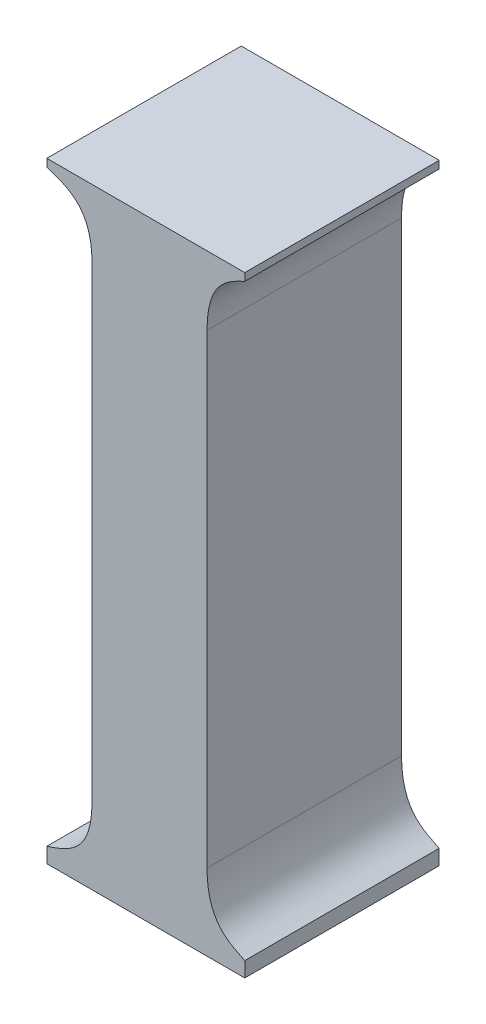
ISO-10303-21;
HEADER;
FILE_DESCRIPTION(('STEP AP214'),'2;1');
FILE_NAME('part.step','',(''),(''),'','','');
FILE_SCHEMA(('AUTOMOTIVE_DESIGN { 1 0 10303 214 1 1 1 1 }'));
ENDSEC;
DATA;
#1=APPLICATION_CONTEXT('core data for automotive mechanical design processes');
#2=APPLICATION_PROTOCOL_DEFINITION('international standard','automotive_design',2000,#1);
#3=PRODUCT_CONTEXT('',#1,'mechanical');
#4=PRODUCT('Part','Part','',(#3));
#5=PRODUCT_RELATED_PRODUCT_CATEGORY('part','',(#4));
#6=PRODUCT_DEFINITION_FORMATION('','',#4);
#7=PRODUCT_DEFINITION_CONTEXT('part definition',#1,'design');
#8=PRODUCT_DEFINITION('design','',#6,#7);
#9=PRODUCT_DEFINITION_SHAPE('','',#8);
#10=(LENGTH_UNIT() NAMED_UNIT(*) SI_UNIT(.MILLI.,.METRE.));
#11=(NAMED_UNIT(*) PLANE_ANGLE_UNIT() SI_UNIT($,.RADIAN.));
#12=(NAMED_UNIT(*) SI_UNIT($,.STERADIAN.) SOLID_ANGLE_UNIT());
#13=UNCERTAINTY_MEASURE_WITH_UNIT(LENGTH_MEASURE(1.E-05),#10,'distance_accuracy_value','');
#14=(GEOMETRIC_REPRESENTATION_CONTEXT(3) GLOBAL_UNCERTAINTY_ASSIGNED_CONTEXT((#13)) GLOBAL_UNIT_ASSIGNED_CONTEXT((#10,
#11,#12)) REPRESENTATION_CONTEXT('',''));
#15=CARTESIAN_POINT('',(0.,0.,0.));
#16=DIRECTION('',(0.,0.,1.));
#17=DIRECTION('',(1.,0.,0.));
#18=AXIS2_PLACEMENT_3D('',#15,#16,#17);
#19=CARTESIAN_POINT('',(2.1818996560859,-0.117918141939838,0.));
#20=DIRECTION('',(-1.,0.,0.));
#21=DIRECTION('',(0.,-1.,0.));
#22=AXIS2_PLACEMENT_3D('',#19,#20,#21);
#23=PLANE('',#22);
#24=DIRECTION('',(0.,1.,0.));
#25=VECTOR('',#24,1.);
#26=CARTESIAN_POINT('',(2.1818996560859,-0.121796249340391,0.));
#27=LINE('',#26,#25);
#28=CARTESIAN_POINT('',(2.1818996560859,-0.121796249340391,0.));
#29=VERTEX_POINT('',#28);
#30=CARTESIAN_POINT('',(2.1818996560859,-0.117918141939838,0.));
#31=VERTEX_POINT('',#30);
#32=EDGE_CURVE('E11',#29,#31,#27,.T.);
#33=ORIENTED_EDGE('',*,*,#32,.F.);
#34=DIRECTION('',(0.,0.,1.));
#35=VECTOR('',#34,1.);
#36=CARTESIAN_POINT('',(2.1818996560859,-0.121796249340391,0.));
#37=LINE('',#36,#35);
#38=CARTESIAN_POINT('',(2.1818996560859,-0.121796249340391,0.1));
#39=VERTEX_POINT('',#38);
#40=EDGE_CURVE('E24',#29,#39,#37,.T.);
#41=ORIENTED_EDGE('',*,*,#40,.T.);
#42=DIRECTION('',(0.,-1.,0.));
#43=VECTOR('',#42,1.);
#44=CARTESIAN_POINT('',(2.1818996560859,-0.121796249340391,0.1));
#45=LINE('',#44,#43);
#46=CARTESIAN_POINT('',(2.1818996560859,-0.117918141939838,0.1));
#47=VERTEX_POINT('',#46);
#48=EDGE_CURVE('E124',#47,#39,#45,.T.);
#49=ORIENTED_EDGE('',*,*,#48,.F.);
#50=DIRECTION('',(0.,0.,1.));
#51=VECTOR('',#50,1.);
#52=CARTESIAN_POINT('',(2.1818996560859,-0.117918141939838,0.));
#53=LINE('',#52,#51);
#54=EDGE_CURVE('E237',#31,#47,#53,.T.);
#55=ORIENTED_EDGE('',*,*,#54,.F.);
#56=EDGE_LOOP('',(#33,#41,#49,#55));
#57=FACE_BOUND('',#56,.T.);
#58=ADVANCED_FACE('F17',(#57),#23,.T.);
#59=CARTESIAN_POINT('',(2.2837012363944,-0.117918141939838,0.));
#60=DIRECTION('',(0.,1.,0.));
#61=DIRECTION('',(-1.,0.,0.));
#62=AXIS2_PLACEMENT_3D('',#59,#60,#61);
#63=PLANE('',#62);
#64=DIRECTION('',(1.,0.,0.));
#65=VECTOR('',#64,1.);
#66=CARTESIAN_POINT('',(2.1818996560859,-0.117918141939838,0.));
#67=LINE('',#66,#65);
#68=CARTESIAN_POINT('',(2.2837012363944,-0.117918141939838,0.));
#69=VERTEX_POINT('',#68);
#70=EDGE_CURVE('E235',#31,#69,#67,.T.);
#71=ORIENTED_EDGE('',*,*,#70,.F.);
#72=ORIENTED_EDGE('',*,*,#54,.T.);
#73=DIRECTION('',(-1.,0.,0.));
#74=VECTOR('',#73,1.);
#75=CARTESIAN_POINT('',(2.1818996560859,-0.117918141939838,0.1));
#76=LINE('',#75,#74);
#77=CARTESIAN_POINT('',(2.2837012363944,-0.117918141939838,0.1));
#78=VERTEX_POINT('',#77);
#79=EDGE_CURVE('E233',#78,#47,#76,.T.);
#80=ORIENTED_EDGE('',*,*,#79,.F.);
#81=DIRECTION('',(0.,0.,1.));
#82=VECTOR('',#81,1.);
#83=CARTESIAN_POINT('',(2.2837012363944,-0.117918141939838,0.));
#84=LINE('',#83,#82);
#85=EDGE_CURVE('E230',#69,#78,#84,.T.);
#86=ORIENTED_EDGE('',*,*,#85,.F.);
#87=EDGE_LOOP('',(#71,#72,#80,#86));
#88=FACE_BOUND('',#87,.T.);
#89=ADVANCED_FACE('F275',(#88),#63,.T.);
#90=CARTESIAN_POINT('',(2.2837012363944,-0.121796249340391,0.));
#91=DIRECTION('',(1.,0.,0.));
#92=DIRECTION('',(0.,1.,0.));
#93=AXIS2_PLACEMENT_3D('',#90,#91,#92);
#94=PLANE('',#93);
#95=DIRECTION('',(0.,-1.,0.));
#96=VECTOR('',#95,1.);
#97=CARTESIAN_POINT('',(2.2837012363944,-0.117918141939838,0.));
#98=LINE('',#97,#96);
#99=CARTESIAN_POINT('',(2.2837012363944,-0.121796249340391,0.));
#100=VERTEX_POINT('',#99);
#101=EDGE_CURVE('E228',#69,#100,#98,.T.);
#102=ORIENTED_EDGE('',*,*,#101,.F.);
#103=ORIENTED_EDGE('',*,*,#85,.T.);
#104=DIRECTION('',(0.,1.,0.));
#105=VECTOR('',#104,1.);
#106=CARTESIAN_POINT('',(2.2837012363944,-0.117918141939838,0.1));
#107=LINE('',#106,#105);
#108=CARTESIAN_POINT('',(2.2837012363944,-0.121796249340391,0.1));
#109=VERTEX_POINT('',#108);
#110=EDGE_CURVE('E225',#109,#78,#107,.T.);
#111=ORIENTED_EDGE('',*,*,#110,.F.);
#112=DIRECTION('',(0.,0.,1.));
#113=VECTOR('',#112,1.);
#114=CARTESIAN_POINT('',(2.2837012363944,-0.121796249340391,0.));
#115=LINE('',#114,#113);
#116=EDGE_CURVE('E219',#100,#109,#115,.T.);
#117=ORIENTED_EDGE('',*,*,#116,.F.);
#118=EDGE_LOOP('',(#102,#103,#111,#117));
#119=FACE_BOUND('',#118,.T.);
#120=ADVANCED_FACE('F271',(#119),#94,.T.);
#121=CARTESIAN_POINT('',(2.2643099787944,-0.153306430432416,0.));
#122=CARTESIAN_POINT('',(2.2643099787944,-0.153306430432416,0.1));
#123=CARTESIAN_POINT('',(2.2643099786788,-0.129552644001781,0.));
#124=CARTESIAN_POINT('',(2.2643099786788,-0.129552644001781,0.1));
#125=CARTESIAN_POINT('',(2.2759450935945,-0.125674356625529,0.));
#126=CARTESIAN_POINT('',(2.2759450935945,-0.125674356625529,0.1));
#127=CARTESIAN_POINT('',(2.2837012363944,-0.121796249340391,0.));
#128=CARTESIAN_POINT('',(2.2837012363944,-0.121796249340391,0.1));
#129=B_SPLINE_SURFACE_WITH_KNOTS('',3,1,((#121,#122),(#123,#124),(#125,#126),(#127,#128)),
.UNSPECIFIED.,.F.,.F.,.F.,(4,4),(2,2),(-1.,0.),(0.,0.01),.UNSPECIFIED.);
#130=CARTESIAN_POINT('',(2.2837012363944,-0.121796249340391,0.));
#131=CARTESIAN_POINT('',(2.2759450935945,-0.125674356625529,0.));
#132=CARTESIAN_POINT('',(2.2643099786788,-0.129552644001781,0.));
#133=CARTESIAN_POINT('',(2.2643099787944,-0.153306430432416,0.));
#134=B_SPLINE_CURVE_WITH_KNOTS('',3,(#130,#131,#132,#133),.UNSPECIFIED.,.F.,.F.,(4,4),(0.,1.),.UNSPECIFIED.);
#135=CARTESIAN_POINT('',(2.2643099787944,-0.153306430432416,0.));
#136=VERTEX_POINT('',#135);
#137=EDGE_CURVE('E212',#100,#136,#134,.T.);
#138=CARTESIAN_POINT('',(2.2643099787944,-0.153306430432416,0.1));
#139=CARTESIAN_POINT('',(2.2643099786788,-0.129552644001781,0.1));
#140=CARTESIAN_POINT('',(2.2759450935945,-0.125674356625529,0.1));
#141=CARTESIAN_POINT('',(2.2837012363944,-0.121796249340391,0.1));
#142=B_SPLINE_CURVE_WITH_KNOTS('',3,(#138,#139,#140,#141),.UNSPECIFIED.,.F.,.F.,(4,4),(-1.,0.),.UNSPECIFIED.);
#143=CARTESIAN_POINT('',(2.2643099787944,-0.153306430432416,0.1));
#144=VERTEX_POINT('',#143);
#145=EDGE_CURVE('E207',#144,#109,#142,.T.);
#146=DIRECTION('',(0.,0.,1.));
#147=VECTOR('',#146,1.);
#148=CARTESIAN_POINT('',(2.2643099787944,-0.153306430432416,0.));
#149=LINE('',#148,#147);
#150=EDGE_CURVE('E204',#136,#144,#149,.T.);
#151=ORIENTED_EDGE('',*,*,#137,.F.);
#152=ORIENTED_EDGE('',*,*,#116,.T.);
#153=ORIENTED_EDGE('',*,*,#145,.F.);
#154=ORIENTED_EDGE('',*,*,#150,.F.);
#155=EDGE_LOOP('',(#151,#152,#153,#154));
#156=FACE_BOUND('',#155,.T.);
#157=ADVANCED_FACE('F267',(#156),#129,.T.);
#158=CARTESIAN_POINT('',(2.2643099787944,-0.392784138206144,0.));
#159=DIRECTION('',(1.,0.,0.));
#160=DIRECTION('',(0.,1.,0.));
#161=AXIS2_PLACEMENT_3D('',#158,#159,#160);
#162=PLANE('',#161);
#163=DIRECTION('',(0.,-1.,0.));
#164=VECTOR('',#163,1.);
#165=CARTESIAN_POINT('',(2.2643099787944,-0.153306430432416,0.));
#166=LINE('',#165,#164);
#167=CARTESIAN_POINT('',(2.2643099787944,-0.392784138206144,0.));
#168=VERTEX_POINT('',#167);
#169=EDGE_CURVE('E202',#136,#168,#166,.T.);
#170=ORIENTED_EDGE('',*,*,#169,.F.);
#171=ORIENTED_EDGE('',*,*,#150,.T.);
#172=DIRECTION('',(0.,1.,0.));
#173=VECTOR('',#172,1.);
#174=CARTESIAN_POINT('',(2.2643099787944,-0.153306430432416,0.1));
#175=LINE('',#174,#173);
#176=CARTESIAN_POINT('',(2.2643099787944,-0.392784138206144,0.1));
#177=VERTEX_POINT('',#176);
#178=EDGE_CURVE('E199',#177,#144,#175,.T.);
#179=ORIENTED_EDGE('',*,*,#178,.F.);
#180=DIRECTION('',(0.,0.,1.));
#181=VECTOR('',#180,1.);
#182=CARTESIAN_POINT('',(2.2643099787944,-0.392784138206144,0.));
#183=LINE('',#182,#181);
#184=EDGE_CURVE('E193',#168,#177,#183,.T.);
#185=ORIENTED_EDGE('',*,*,#184,.F.);
#186=EDGE_LOOP('',(#170,#171,#179,#185));
#187=FACE_BOUND('',#186,.T.);
#188=ADVANCED_FACE('F263',(#187),#162,.T.);
#189=CARTESIAN_POINT('',(2.2837012363944,-0.424294319298148,0.));
#190=CARTESIAN_POINT('',(2.2837012363944,-0.424294319298148,0.1));
#191=CARTESIAN_POINT('',(2.2759450936526,-0.420416067777875,0.));
#192=CARTESIAN_POINT('',(2.2759450936526,-0.420416067777875,0.1));
#193=CARTESIAN_POINT('',(2.2643099787946,-0.416537924348324,0.));
#194=CARTESIAN_POINT('',(2.2643099787946,-0.416537924348324,0.1));
#195=CARTESIAN_POINT('',(2.2643099787944,-0.392784138206144,0.));
#196=CARTESIAN_POINT('',(2.2643099787944,-0.392784138206144,0.1));
#197=B_SPLINE_SURFACE_WITH_KNOTS('',3,1,((#189,#190),(#191,#192),(#193,#194),(#195,#196)),
.UNSPECIFIED.,.F.,.F.,.F.,(4,4),(2,2),(-1.,0.),(0.,0.01),.UNSPECIFIED.);
#198=CARTESIAN_POINT('',(2.2643099787944,-0.392784138206144,0.));
#199=CARTESIAN_POINT('',(2.2643099787946,-0.416537924348324,0.));
#200=CARTESIAN_POINT('',(2.2759450936526,-0.420416067777875,0.));
#201=CARTESIAN_POINT('',(2.2837012363944,-0.424294319298148,0.));
#202=B_SPLINE_CURVE_WITH_KNOTS('',3,(#198,#199,#200,#201),.UNSPECIFIED.,.F.,.F.,(4,4),(0.,1.),.UNSPECIFIED.);
#203=CARTESIAN_POINT('',(2.2837012363944,-0.424294319298148,0.));
#204=VERTEX_POINT('',#203);
#205=EDGE_CURVE('E186',#168,#204,#202,.T.);
#206=CARTESIAN_POINT('',(2.2837012363944,-0.424294319298148,0.1));
#207=CARTESIAN_POINT('',(2.2759450936526,-0.420416067777875,0.1));
#208=CARTESIAN_POINT('',(2.2643099787946,-0.416537924348324,0.1));
#209=CARTESIAN_POINT('',(2.2643099787944,-0.392784138206144,0.1));
#210=B_SPLINE_CURVE_WITH_KNOTS('',3,(#206,#207,#208,#209),.UNSPECIFIED.,.F.,.F.,(4,4),(-1.,0.),.UNSPECIFIED.);
#211=CARTESIAN_POINT('',(2.2837012363944,-0.424294319298148,0.1));
#212=VERTEX_POINT('',#211);
#213=EDGE_CURVE('E181',#212,#177,#210,.T.);
#214=DIRECTION('',(0.,0.,1.));
#215=VECTOR('',#214,1.);
#216=CARTESIAN_POINT('',(2.2837012363944,-0.424294319298148,0.));
#217=LINE('',#216,#215);
#218=EDGE_CURVE('E178',#204,#212,#217,.T.);
#219=ORIENTED_EDGE('',*,*,#205,.F.);
#220=ORIENTED_EDGE('',*,*,#184,.T.);
#221=ORIENTED_EDGE('',*,*,#213,.F.);
#222=ORIENTED_EDGE('',*,*,#218,.F.);
#223=EDGE_LOOP('',(#219,#220,#221,#222));
#224=FACE_BOUND('',#223,.T.);
#225=ADVANCED_FACE('F259',(#224),#197,.T.);
#226=CARTESIAN_POINT('',(2.2837012363944,-0.432050714249068,0.));
#227=DIRECTION('',(1.,0.,0.));
#228=DIRECTION('',(0.,1.,0.));
#229=AXIS2_PLACEMENT_3D('',#226,#227,#228);
#230=PLANE('',#229);
#231=DIRECTION('',(0.,-1.,0.));
#232=VECTOR('',#231,1.);
#233=CARTESIAN_POINT('',(2.2837012363944,-0.424294319298148,0.));
#234=LINE('',#233,#232);
#235=CARTESIAN_POINT('',(2.2837012363944,-0.432050714249068,0.));
#236=VERTEX_POINT('',#235);
#237=EDGE_CURVE('E176',#204,#236,#234,.T.);
#238=ORIENTED_EDGE('',*,*,#237,.F.);
#239=ORIENTED_EDGE('',*,*,#218,.T.);
#240=DIRECTION('',(0.,1.,0.));
#241=VECTOR('',#240,1.);
#242=CARTESIAN_POINT('',(2.2837012363944,-0.424294319298148,0.1));
#243=LINE('',#242,#241);
#244=CARTESIAN_POINT('',(2.2837012363944,-0.432050714249068,0.1));
#245=VERTEX_POINT('',#244);
#246=EDGE_CURVE('E173',#245,#212,#243,.T.);
#247=ORIENTED_EDGE('',*,*,#246,.F.);
#248=DIRECTION('',(0.,0.,1.));
#249=VECTOR('',#248,1.);
#250=CARTESIAN_POINT('',(2.2837012363944,-0.432050714249068,0.));
#251=LINE('',#250,#249);
#252=EDGE_CURVE('E170',#236,#245,#251,.T.);
#253=ORIENTED_EDGE('',*,*,#252,.F.);
#254=EDGE_LOOP('',(#238,#239,#247,#253));
#255=FACE_BOUND('',#254,.T.);
#256=ADVANCED_FACE('F255',(#255),#230,.T.);
#257=CARTESIAN_POINT('',(2.1818996560859,-0.432050714249068,0.));
#258=DIRECTION('',(0.,-1.,0.));
#259=DIRECTION('',(1.,0.,0.));
#260=AXIS2_PLACEMENT_3D('',#257,#258,#259);
#261=PLANE('',#260);
#262=DIRECTION('',(-1.,0.,0.));
#263=VECTOR('',#262,1.);
#264=CARTESIAN_POINT('',(2.2837012363944,-0.432050714249068,0.));
#265=LINE('',#264,#263);
#266=CARTESIAN_POINT('',(2.1818996560859,-0.432050714249068,0.));
#267=VERTEX_POINT('',#266);
#268=EDGE_CURVE('E168',#236,#267,#265,.T.);
#269=ORIENTED_EDGE('',*,*,#268,.F.);
#270=ORIENTED_EDGE('',*,*,#252,.T.);
#271=DIRECTION('',(1.,0.,0.));
#272=VECTOR('',#271,1.);
#273=CARTESIAN_POINT('',(2.2837012363944,-0.432050714249068,0.1));
#274=LINE('',#273,#272);
#275=CARTESIAN_POINT('',(2.1818996560859,-0.432050714249068,0.1));
#276=VERTEX_POINT('',#275);
#277=EDGE_CURVE('E165',#276,#245,#274,.T.);
#278=ORIENTED_EDGE('',*,*,#277,.F.);
#279=DIRECTION('',(0.,0.,1.));
#280=VECTOR('',#279,1.);
#281=CARTESIAN_POINT('',(2.1818996560859,-0.432050714249068,0.));
#282=LINE('',#281,#280);
#283=EDGE_CURVE('E162',#267,#276,#282,.T.);
#284=ORIENTED_EDGE('',*,*,#283,.F.);
#285=EDGE_LOOP('',(#269,#270,#278,#284));
#286=FACE_BOUND('',#285,.T.);
#287=ADVANCED_FACE('F251',(#286),#261,.T.);
#288=CARTESIAN_POINT('',(2.1818996560859,-0.424294319298148,0.));
#289=DIRECTION('',(-1.,0.,0.));
#290=DIRECTION('',(0.,-1.,0.));
#291=AXIS2_PLACEMENT_3D('',#288,#289,#290);
#292=PLANE('',#291);
#293=DIRECTION('',(0.,1.,0.));
#294=VECTOR('',#293,1.);
#295=CARTESIAN_POINT('',(2.1818996560859,-0.432050714249068,0.));
#296=LINE('',#295,#294);
#297=CARTESIAN_POINT('',(2.1818996560859,-0.424294319298148,0.));
#298=VERTEX_POINT('',#297);
#299=EDGE_CURVE('E160',#267,#298,#296,.T.);
#300=ORIENTED_EDGE('',*,*,#299,.F.);
#301=ORIENTED_EDGE('',*,*,#283,.T.);
#302=DIRECTION('',(0.,-1.,0.));
#303=VECTOR('',#302,1.);
#304=CARTESIAN_POINT('',(2.1818996560859,-0.432050714249068,0.1));
#305=LINE('',#304,#303);
#306=CARTESIAN_POINT('',(2.1818996560859,-0.424294319298148,0.1));
#307=VERTEX_POINT('',#306);
#308=EDGE_CURVE('E157',#307,#276,#305,.T.);
#309=ORIENTED_EDGE('',*,*,#308,.F.);
#310=DIRECTION('',(0.,0.,1.));
#311=VECTOR('',#310,1.);
#312=CARTESIAN_POINT('',(2.1818996560859,-0.424294319298148,0.));
#313=LINE('',#312,#311);
#314=EDGE_CURVE('E151',#298,#307,#313,.T.);
#315=ORIENTED_EDGE('',*,*,#314,.F.);
#316=EDGE_LOOP('',(#300,#301,#309,#315));
#317=FACE_BOUND('',#316,.T.);
#318=ADVANCED_FACE('F247',(#317),#292,.T.);
#319=CARTESIAN_POINT('',(2.2051684446085,-0.392784138206144,0.));
#320=CARTESIAN_POINT('',(2.2051684446085,-0.392784138206144,0.1));
#321=CARTESIAN_POINT('',(2.2051684444927,-0.416537924001515,0.));
#322=CARTESIAN_POINT('',(2.2051684444927,-0.416537924001515,0.1));
#323=CARTESIAN_POINT('',(2.193533329692,-0.42041606760447,0.));
#324=CARTESIAN_POINT('',(2.193533329692,-0.42041606760447,0.1));
#325=CARTESIAN_POINT('',(2.1818996560859,-0.424294319298148,0.));
#326=CARTESIAN_POINT('',(2.1818996560859,-0.424294319298148,0.1));
#327=B_SPLINE_SURFACE_WITH_KNOTS('',3,1,((#319,#320),(#321,#322),(#323,#324),(#325,#326)),
.UNSPECIFIED.,.F.,.F.,.F.,(4,4),(2,2),(-1.,0.),(0.,0.01),.UNSPECIFIED.);
#328=CARTESIAN_POINT('',(2.1818996560859,-0.424294319298148,0.));
#329=CARTESIAN_POINT('',(2.193533329692,-0.42041606760447,0.));
#330=CARTESIAN_POINT('',(2.2051684444927,-0.416537924001515,0.));
#331=CARTESIAN_POINT('',(2.2051684446085,-0.392784138206144,0.));
#332=B_SPLINE_CURVE_WITH_KNOTS('',3,(#328,#329,#330,#331),.UNSPECIFIED.,.F.,.F.,(4,4),(0.,1.),.UNSPECIFIED.);
#333=CARTESIAN_POINT('',(2.2051684446085,-0.392784138206144,0.));
#334=VERTEX_POINT('',#333);
#335=EDGE_CURVE('E144',#298,#334,#332,.T.);
#336=CARTESIAN_POINT('',(2.2051684446085,-0.392784138206144,0.1));
#337=CARTESIAN_POINT('',(2.2051684444927,-0.416537924001515,0.1));
#338=CARTESIAN_POINT('',(2.193533329692,-0.42041606760447,0.1));
#339=CARTESIAN_POINT('',(2.1818996560859,-0.424294319298148,0.1));
#340=B_SPLINE_CURVE_WITH_KNOTS('',3,(#336,#337,#338,#339),.UNSPECIFIED.,.F.,.F.,(4,4),(-1.,0.),.UNSPECIFIED.);
#341=CARTESIAN_POINT('',(2.2051684446085,-0.392784138206144,0.1));
#342=VERTEX_POINT('',#341);
#343=EDGE_CURVE('E140',#342,#307,#340,.T.);
#344=DIRECTION('',(0.,0.,1.));
#345=VECTOR('',#344,1.);
#346=CARTESIAN_POINT('',(2.2051684446085,-0.392784138206144,0.));
#347=LINE('',#346,#345);
#348=EDGE_CURVE('E109',#334,#342,#347,.T.);
#349=ORIENTED_EDGE('',*,*,#335,.F.);
#350=ORIENTED_EDGE('',*,*,#314,.T.);
#351=ORIENTED_EDGE('',*,*,#343,.F.);
#352=ORIENTED_EDGE('',*,*,#348,.F.);
#353=EDGE_LOOP('',(#349,#350,#351,#352));
#354=FACE_BOUND('',#353,.T.);
#355=ADVANCED_FACE('F245',(#354),#327,.T.);
#356=CARTESIAN_POINT('',(2.2051684446085,-0.153306430432416,0.));
#357=DIRECTION('',(-1.,0.,0.));
#358=DIRECTION('',(0.,-1.,0.));
#359=AXIS2_PLACEMENT_3D('',#356,#357,#358);
#360=PLANE('',#359);
#361=DIRECTION('',(0.,1.,0.));
#362=VECTOR('',#361,1.);
#363=CARTESIAN_POINT('',(2.2051684446085,-0.392784138206144,0.));
#364=LINE('',#363,#362);
#365=CARTESIAN_POINT('',(2.2051684446085,-0.153306430432416,0.));
#366=VERTEX_POINT('',#365);
#367=EDGE_CURVE('E113',#334,#366,#364,.T.);
#368=ORIENTED_EDGE('',*,*,#367,.F.);
#369=ORIENTED_EDGE('',*,*,#348,.T.);
#370=DIRECTION('',(0.,-1.,0.));
#371=VECTOR('',#370,1.);
#372=CARTESIAN_POINT('',(2.2051684446085,-0.392784138206144,0.1));
#373=LINE('',#372,#371);
#374=CARTESIAN_POINT('',(2.2051684446085,-0.153306430432416,0.1));
#375=VERTEX_POINT('',#374);
#376=EDGE_CURVE('E102',#375,#342,#373,.T.);
#377=ORIENTED_EDGE('',*,*,#376,.F.);
#378=DIRECTION('',(0.,0.,1.));
#379=VECTOR('',#378,1.);
#380=CARTESIAN_POINT('',(2.2051684446085,-0.153306430432416,0.));
#381=LINE('',#380,#379);
#382=EDGE_CURVE('E106',#366,#375,#381,.T.);
#383=ORIENTED_EDGE('',*,*,#382,.F.);
#384=EDGE_LOOP('',(#368,#369,#377,#383));
#385=FACE_BOUND('',#384,.T.);
#386=ADVANCED_FACE('F105',(#385),#360,.T.);
#387=CARTESIAN_POINT('',(2.1818996560859,-0.121796249340391,0.));
#388=CARTESIAN_POINT('',(2.1818996560859,-0.121796249340391,0.1));
#389=CARTESIAN_POINT('',(2.1935333291675,-0.12567435698608,0.));
#390=CARTESIAN_POINT('',(2.1935333291675,-0.12567435698608,0.1));
#391=CARTESIAN_POINT('',(2.2051684441077,-0.129552644290642,0.));
#392=CARTESIAN_POINT('',(2.2051684441077,-0.129552644290642,0.1));
#393=CARTESIAN_POINT('',(2.2051684446085,-0.153306430432416,0.));
#394=CARTESIAN_POINT('',(2.2051684446085,-0.153306430432416,0.1));
#395=B_SPLINE_SURFACE_WITH_KNOTS('',3,1,((#387,#388),(#389,#390),(#391,#392),(#393,#394)),
.UNSPECIFIED.,.F.,.F.,.F.,(4,4),(2,2),(-1.,0.),(0.,0.01),.UNSPECIFIED.);
#396=CARTESIAN_POINT('',(2.2051684446085,-0.153306430432416,0.));
#397=CARTESIAN_POINT('',(2.2051684441077,-0.129552644290642,0.));
#398=CARTESIAN_POINT('',(2.1935333291675,-0.12567435698608,0.));
#399=CARTESIAN_POINT('',(2.1818996560859,-0.121796249340391,0.));
#400=B_SPLINE_CURVE_WITH_KNOTS('',3,(#396,#397,#398,#399),.UNSPECIFIED.,.F.,.F.,(4,4),(0.,1.),.UNSPECIFIED.);
#401=EDGE_CURVE('E119',#366,#29,#400,.T.);
#402=CARTESIAN_POINT('',(2.1818996560859,-0.121796249340391,0.1));
#403=CARTESIAN_POINT('',(2.1935333291675,-0.12567435698608,0.1));
#404=CARTESIAN_POINT('',(2.2051684441077,-0.129552644290642,0.1));
#405=CARTESIAN_POINT('',(2.2051684446085,-0.153306430432416,0.1));
#406=B_SPLINE_CURVE_WITH_KNOTS('',3,(#402,#403,#404,#405),.UNSPECIFIED.,.F.,.F.,(4,4),(-1.,0.),.UNSPECIFIED.);
#407=EDGE_CURVE('E118',#39,#375,#406,.T.);
#408=ORIENTED_EDGE('',*,*,#401,.F.);
#409=ORIENTED_EDGE('',*,*,#382,.T.);
#410=ORIENTED_EDGE('',*,*,#407,.F.);
#411=ORIENTED_EDGE('',*,*,#40,.F.);
#412=EDGE_LOOP('',(#408,#409,#410,#411));
#413=FACE_BOUND('',#412,.T.);
#414=ADVANCED_FACE('F117',(#413),#395,.T.);
#415=CARTESIAN_POINT('',(2.2338907855461,-0.274987711990072,0.));
#416=DIRECTION('',(0.,0.,1.));
#417=DIRECTION('',(1.,0.,0.));
#418=AXIS2_PLACEMENT_3D('',#415,#416,#417);
#419=PLANE('',#418);
#420=ORIENTED_EDGE('',*,*,#401,.T.);
#421=ORIENTED_EDGE('',*,*,#32,.T.);
#422=ORIENTED_EDGE('',*,*,#70,.T.);
#423=ORIENTED_EDGE('',*,*,#101,.T.);
#424=ORIENTED_EDGE('',*,*,#137,.T.);
#425=ORIENTED_EDGE('',*,*,#169,.T.);
#426=ORIENTED_EDGE('',*,*,#205,.T.);
#427=ORIENTED_EDGE('',*,*,#237,.T.);
#428=ORIENTED_EDGE('',*,*,#268,.T.);
#429=ORIENTED_EDGE('',*,*,#299,.T.);
#430=ORIENTED_EDGE('',*,*,#335,.T.);
#431=ORIENTED_EDGE('',*,*,#367,.T.);
#432=EDGE_LOOP('',(#420,#421,#422,#423,#424,#425,#426,#427,#428,#429,#430,#431));
#433=FACE_BOUND('',#432,.T.);
#434=ADVANCED_FACE('F240',(#433),#419,.F.);
#435=CARTESIAN_POINT('',(2.2338907855461,-0.274987711990072,0.1));
#436=DIRECTION('',(0.,0.,1.));
#437=DIRECTION('',(1.,0.,0.));
#438=AXIS2_PLACEMENT_3D('',#435,#436,#437);
#439=PLANE('',#438);
#440=ORIENTED_EDGE('',*,*,#407,.T.);
#441=ORIENTED_EDGE('',*,*,#376,.T.);
#442=ORIENTED_EDGE('',*,*,#343,.T.);
#443=ORIENTED_EDGE('',*,*,#308,.T.);
#444=ORIENTED_EDGE('',*,*,#277,.T.);
#445=ORIENTED_EDGE('',*,*,#246,.T.);
#446=ORIENTED_EDGE('',*,*,#213,.T.);
#447=ORIENTED_EDGE('',*,*,#178,.T.);
#448=ORIENTED_EDGE('',*,*,#145,.T.);
#449=ORIENTED_EDGE('',*,*,#110,.T.);
#450=ORIENTED_EDGE('',*,*,#79,.T.);
#451=ORIENTED_EDGE('',*,*,#48,.T.);
#452=EDGE_LOOP('',(#440,#441,#442,#443,#444,#445,#446,#447,#448,#449,#450,#451));
#453=FACE_BOUND('',#452,.T.);
#454=ADVANCED_FACE('F122',(#453),#439,.T.);
#455=CLOSED_SHELL('',(#58,#89,#120,#157,#188,#225,#256,#287,#318,#355,#386,#414,#434,#454));
#456=MANIFOLD_SOLID_BREP('B1',#455);
#457=ADVANCED_BREP_SHAPE_REPRESENTATION('',(#18,#456),#14);
#458=SHAPE_DEFINITION_REPRESENTATION(#9,#457);
ENDSEC;
END-ISO-10303-21;
